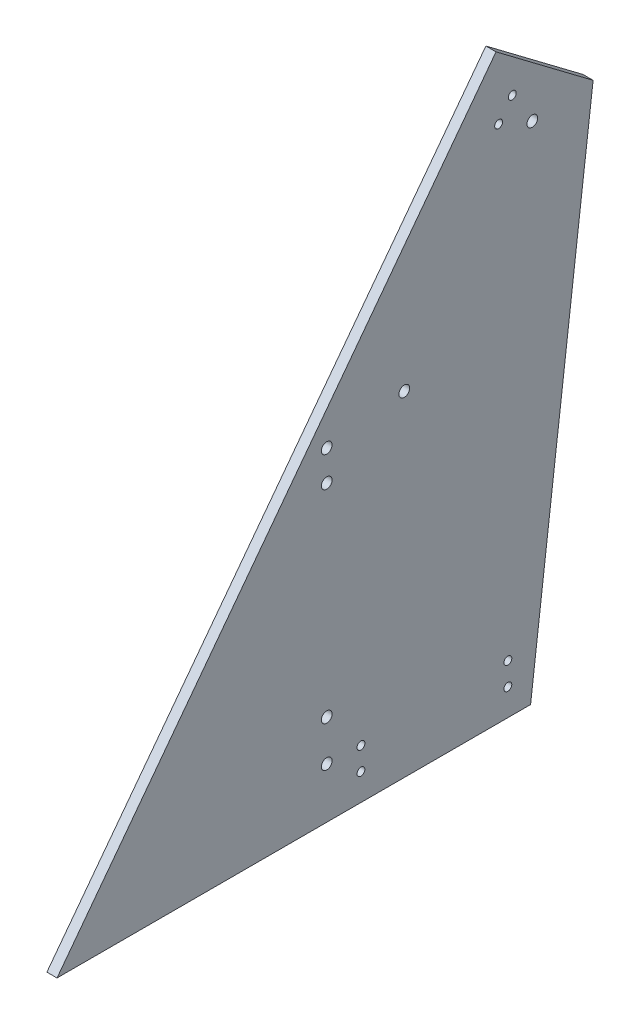
ISO-10303-21;
HEADER;
FILE_DESCRIPTION(('STEP AP214'),'2;1');
FILE_NAME('part.step','',(''),(''),'','','');
FILE_SCHEMA(('AUTOMOTIVE_DESIGN { 1 0 10303 214 1 1 1 1 }'));
ENDSEC;
DATA;
#1=APPLICATION_CONTEXT('core data for automotive mechanical design processes');
#2=APPLICATION_PROTOCOL_DEFINITION('international standard','automotive_design',2000,#1);
#3=PRODUCT_CONTEXT('',#1,'mechanical');
#4=PRODUCT('Part','Part','',(#3));
#5=PRODUCT_RELATED_PRODUCT_CATEGORY('part','',(#4));
#6=PRODUCT_DEFINITION_FORMATION('','',#4);
#7=PRODUCT_DEFINITION_CONTEXT('part definition',#1,'design');
#8=PRODUCT_DEFINITION('design','',#6,#7);
#9=PRODUCT_DEFINITION_SHAPE('','',#8);
#10=(LENGTH_UNIT() NAMED_UNIT(*) SI_UNIT(.MILLI.,.METRE.));
#11=(NAMED_UNIT(*) PLANE_ANGLE_UNIT() SI_UNIT($,.RADIAN.));
#12=(NAMED_UNIT(*) SI_UNIT($,.STERADIAN.) SOLID_ANGLE_UNIT());
#13=UNCERTAINTY_MEASURE_WITH_UNIT(LENGTH_MEASURE(1.E-05),#10,'distance_accuracy_value','');
#14=(GEOMETRIC_REPRESENTATION_CONTEXT(3) GLOBAL_UNCERTAINTY_ASSIGNED_CONTEXT((#13)) GLOBAL_UNIT_ASSIGNED_CONTEXT((#10,
#11,#12)) REPRESENTATION_CONTEXT('',''));
#15=CARTESIAN_POINT('',(0.,0.,0.));
#16=DIRECTION('',(0.,0.,1.));
#17=DIRECTION('',(1.,0.,0.));
#18=AXIS2_PLACEMENT_3D('',#15,#16,#17);
#19=CARTESIAN_POINT('',(6.35,0.,-296.803463779718));
#20=DIRECTION('',(0.,1.,0.));
#21=DIRECTION('',(0.,0.,1.));
#22=AXIS2_PLACEMENT_3D('',#19,#20,#21);
#23=PLANE('',#22);
#24=DIRECTION('',(0.,0.,-1.));
#25=VECTOR('',#24,1.);
#26=CARTESIAN_POINT('',(0.,0.,-296.803463779718));
#27=LINE('',#26,#25);
#28=CARTESIAN_POINT('',(0.,0.,0.));
#29=VERTEX_POINT('',#28);
#30=CARTESIAN_POINT('',(0.,0.,-296.803463779718));
#31=VERTEX_POINT('',#30);
#32=EDGE_CURVE('E100',#29,#31,#27,.T.);
#33=ORIENTED_EDGE('',*,*,#32,.T.);
#34=DIRECTION('',(-1.,0.,0.));
#35=VECTOR('',#34,1.);
#36=CARTESIAN_POINT('',(6.35,0.,-296.803463779718));
#37=LINE('',#36,#35);
#38=CARTESIAN_POINT('',(6.35,0.,-296.803463779718));
#39=VERTEX_POINT('',#38);
#40=EDGE_CURVE('E11',#39,#31,#37,.T.);
#41=ORIENTED_EDGE('',*,*,#40,.F.);
#42=DIRECTION('',(0.,0.,-1.));
#43=VECTOR('',#42,1.);
#44=CARTESIAN_POINT('',(6.35,0.,-296.803463779718));
#45=LINE('',#44,#43);
#46=CARTESIAN_POINT('',(6.35,0.,0.));
#47=VERTEX_POINT('',#46);
#48=EDGE_CURVE('E88',#47,#39,#45,.T.);
#49=ORIENTED_EDGE('',*,*,#48,.F.);
#50=DIRECTION('',(-1.,0.,0.));
#51=VECTOR('',#50,1.);
#52=CARTESIAN_POINT('',(6.35,0.,0.));
#53=LINE('',#52,#51);
#54=EDGE_CURVE('E96',#47,#29,#53,.T.);
#55=ORIENTED_EDGE('',*,*,#54,.T.);
#56=EDGE_LOOP('',(#33,#41,#49,#55));
#57=FACE_BOUND('',#56,.T.);
#58=ADVANCED_FACE('F37',(#57),#23,.F.);
#59=CARTESIAN_POINT('',(6.35,319.277850429435,-336.005854450722));
#60=DIRECTION('',(0.,0.121869343405155,0.992546151641321));
#61=DIRECTION('',(0.,-0.992546151641321,0.121869343405155));
#62=AXIS2_PLACEMENT_3D('',#59,#60,#61);
#63=PLANE('',#62);
#64=DIRECTION('',(0.,0.992546151641321,-0.121869343405155));
#65=VECTOR('',#64,1.);
#66=CARTESIAN_POINT('',(0.,319.277850429435,-336.005854450722));
#67=LINE('',#66,#65);
#68=CARTESIAN_POINT('',(0.,319.277850429435,-336.005854450722));
#69=VERTEX_POINT('',#68);
#70=EDGE_CURVE('E92',#31,#69,#67,.T.);
#71=ORIENTED_EDGE('',*,*,#70,.T.);
#72=DIRECTION('',(-1.,0.,0.));
#73=VECTOR('',#72,1.);
#74=CARTESIAN_POINT('',(6.35,319.277850429435,-336.005854450722));
#75=LINE('',#74,#73);
#76=CARTESIAN_POINT('',(6.35,319.277850429435,-336.005854450722));
#77=VERTEX_POINT('',#76);
#78=EDGE_CURVE('E45',#77,#69,#75,.T.);
#79=ORIENTED_EDGE('',*,*,#78,.F.);
#80=DIRECTION('',(0.,0.992546151641321,-0.121869343405155));
#81=VECTOR('',#80,1.);
#82=CARTESIAN_POINT('',(6.35,319.277850429435,-336.005854450722));
#83=LINE('',#82,#81);
#84=EDGE_CURVE('E83',#39,#77,#83,.T.);
#85=ORIENTED_EDGE('',*,*,#84,.F.);
#86=ORIENTED_EDGE('',*,*,#40,.T.);
#87=EDGE_LOOP('',(#71,#79,#85,#86));
#88=FACE_BOUND('',#87,.T.);
#89=ADVANCED_FACE('F91',(#88),#63,.F.);
#90=CARTESIAN_POINT('',(6.35,365.136155193621,-275.149828585118));
#91=DIRECTION('',(0.,-0.79863551004729,0.601815023152052));
#92=DIRECTION('',(0.,-0.601815023152052,-0.79863551004729));
#93=AXIS2_PLACEMENT_3D('',#90,#91,#92);
#94=PLANE('',#93);
#95=DIRECTION('',(0.,0.601815023152052,0.79863551004729));
#96=VECTOR('',#95,1.);
#97=CARTESIAN_POINT('',(0.,365.136155193621,-275.149828585118));
#98=LINE('',#97,#96);
#99=CARTESIAN_POINT('',(0.,365.136155193621,-275.149828585118));
#100=VERTEX_POINT('',#99);
#101=EDGE_CURVE('E70',#69,#100,#98,.T.);
#102=ORIENTED_EDGE('',*,*,#101,.T.);
#103=DIRECTION('',(-1.,0.,0.));
#104=VECTOR('',#103,1.);
#105=CARTESIAN_POINT('',(6.35,365.136155193621,-275.149828585118));
#106=LINE('',#105,#104);
#107=CARTESIAN_POINT('',(6.35,365.136155193621,-275.149828585118));
#108=VERTEX_POINT('',#107);
#109=EDGE_CURVE('E93',#108,#100,#106,.T.);
#110=ORIENTED_EDGE('',*,*,#109,.F.);
#111=DIRECTION('',(0.,0.601815023152052,0.79863551004729));
#112=VECTOR('',#111,1.);
#113=CARTESIAN_POINT('',(6.35,365.136155193621,-275.149828585118));
#114=LINE('',#113,#112);
#115=EDGE_CURVE('E86',#77,#108,#114,.T.);
#116=ORIENTED_EDGE('',*,*,#115,.F.);
#117=ORIENTED_EDGE('',*,*,#78,.T.);
#118=EDGE_LOOP('',(#102,#110,#116,#117));
#119=FACE_BOUND('',#118,.T.);
#120=ADVANCED_FACE('F94',(#119),#94,.F.);
#121=CARTESIAN_POINT('',(6.35,0.,0.));
#122=DIRECTION('',(0.,-0.601815023152052,-0.79863551004729));
#123=DIRECTION('',(0.,0.79863551004729,-0.601815023152052));
#124=AXIS2_PLACEMENT_3D('',#121,#122,#123);
#125=PLANE('',#124);
#126=DIRECTION('',(0.,-0.79863551004729,0.601815023152052));
#127=VECTOR('',#126,1.);
#128=CARTESIAN_POINT('',(0.,0.,0.));
#129=LINE('',#128,#127);
#130=EDGE_CURVE('E76',#100,#29,#129,.T.);
#131=ORIENTED_EDGE('',*,*,#130,.T.);
#132=ORIENTED_EDGE('',*,*,#54,.F.);
#133=DIRECTION('',(0.,-0.79863551004729,0.601815023152052));
#134=VECTOR('',#133,1.);
#135=CARTESIAN_POINT('',(6.35,0.,0.));
#136=LINE('',#135,#134);
#137=EDGE_CURVE('E53',#108,#47,#136,.T.);
#138=ORIENTED_EDGE('',*,*,#137,.F.);
#139=ORIENTED_EDGE('',*,*,#109,.T.);
#140=EDGE_LOOP('',(#131,#132,#138,#139));
#141=FACE_BOUND('',#140,.T.);
#142=ADVANCED_FACE('F108',(#141),#125,.F.);
#143=CARTESIAN_POINT('',(6.35,0.,0.));
#144=DIRECTION('',(1.,0.,0.));
#145=DIRECTION('',(0.,0.,-1.));
#146=AXIS2_PLACEMENT_3D('',#143,#144,#145);
#147=PLANE('',#146);
#148=CARTESIAN_POINT('',(6.35,316.189372760803,-297.898743163058));
#149=DIRECTION('',(1.,0.,0.));
#150=DIRECTION('',(0.,0.,-1.));
#151=AXIS2_PLACEMENT_3D('',#148,#149,#150);
#152=CIRCLE('',#151,3.36550000000002);
#153=CARTESIAN_POINT('',(6.35,316.189372760803,-301.264243163058));
#154=VERTEX_POINT('',#153);
#155=EDGE_CURVE('E180',#154,#154,#152,.T.);
#156=ORIENTED_EDGE('',*,*,#155,.F.);
#157=EDGE_LOOP('',(#156));
#158=FACE_BOUND('',#157,.T.);
#159=CARTESIAN_POINT('',(6.35,209.691327495997,-217.646709825732));
#160=DIRECTION('',(1.,0.,0.));
#161=DIRECTION('',(0.,0.,-1.));
#162=AXIS2_PLACEMENT_3D('',#159,#160,#161);
#163=CIRCLE('',#162,3.36550000000002);
#164=CARTESIAN_POINT('',(6.35,209.691327495997,-221.012209825732));
#165=VERTEX_POINT('',#164);
#166=EDGE_CURVE('E174',#165,#165,#163,.T.);
#167=ORIENTED_EDGE('',*,*,#166,.F.);
#168=EDGE_LOOP('',(#167));
#169=FACE_BOUND('',#168,.T.);
#170=CARTESIAN_POINT('',(6.35,336.461727915126,-285.346343492198));
#171=DIRECTION('',(1.,0.,0.));
#172=DIRECTION('',(0.,0.,-1.));
#173=AXIS2_PLACEMENT_3D('',#170,#171,#172);
#174=CIRCLE('',#173,2.4638);
#175=CARTESIAN_POINT('',(6.35,336.461727915126,-287.810143492198));
#176=VERTEX_POINT('',#175);
#177=EDGE_CURVE('E156',#176,#176,#174,.T.);
#178=ORIENTED_EDGE('',*,*,#177,.F.);
#179=EDGE_LOOP('',(#178));
#180=FACE_BOUND('',#179,.T.);
#181=CARTESIAN_POINT('',(6.35,16.764,-282.575));
#182=DIRECTION('',(1.,0.,0.));
#183=DIRECTION('',(0.,0.,-1.));
#184=AXIS2_PLACEMENT_3D('',#181,#182,#183);
#185=CIRCLE('',#184,2.4638);
#186=CARTESIAN_POINT('',(6.35,16.764,-285.0388));
#187=VERTEX_POINT('',#186);
#188=EDGE_CURVE('E163',#187,#187,#185,.T.);
#189=ORIENTED_EDGE('',*,*,#188,.F.);
#190=EDGE_LOOP('',(#189));
#191=FACE_BOUND('',#190,.T.);
#192=CARTESIAN_POINT('',(6.35,30.988,-282.575));
#193=DIRECTION('',(1.,0.,0.));
#194=DIRECTION('',(0.,0.,-1.));
#195=AXIS2_PLACEMENT_3D('',#192,#193,#194);
#196=CIRCLE('',#195,2.4638);
#197=CARTESIAN_POINT('',(6.35,30.988,-285.0388));
#198=VERTEX_POINT('',#197);
#199=EDGE_CURVE('E144',#198,#198,#196,.T.);
#200=ORIENTED_EDGE('',*,*,#199,.F.);
#201=EDGE_LOOP('',(#200));
#202=FACE_BOUND('',#201,.T.);
#203=CARTESIAN_POINT('',(6.35,16.764,-190.5));
#204=DIRECTION('',(1.,0.,0.));
#205=DIRECTION('',(0.,0.,-1.));
#206=AXIS2_PLACEMENT_3D('',#203,#204,#205);
#207=CIRCLE('',#206,2.4638);
#208=CARTESIAN_POINT('',(6.35,16.764,-192.9638));
#209=VERTEX_POINT('',#208);
#210=EDGE_CURVE('E151',#209,#209,#207,.T.);
#211=ORIENTED_EDGE('',*,*,#210,.F.);
#212=EDGE_LOOP('',(#211));
#213=FACE_BOUND('',#212,.T.);
#214=CARTESIAN_POINT('',(6.35,325.101936420213,-276.786126602884));
#215=DIRECTION('',(1.,0.,0.));
#216=DIRECTION('',(0.,0.,-1.));
#217=AXIS2_PLACEMENT_3D('',#214,#215,#216);
#218=CIRCLE('',#217,2.4638);
#219=CARTESIAN_POINT('',(6.35,325.101936420213,-279.249926602884));
#220=VERTEX_POINT('',#219);
#221=EDGE_CURVE('E168',#220,#220,#218,.T.);
#222=ORIENTED_EDGE('',*,*,#221,.F.);
#223=EDGE_LOOP('',(#222));
#224=FACE_BOUND('',#223,.T.);
#225=CARTESIAN_POINT('',(6.35,30.988,-190.5));
#226=DIRECTION('',(1.,0.,0.));
#227=DIRECTION('',(0.,0.,-1.));
#228=AXIS2_PLACEMENT_3D('',#225,#226,#227);
#229=CIRCLE('',#228,2.4638);
#230=CARTESIAN_POINT('',(6.35,30.988,-192.9638));
#231=VERTEX_POINT('',#230);
#232=EDGE_CURVE('E138',#231,#231,#229,.T.);
#233=ORIENTED_EDGE('',*,*,#232,.F.);
#234=EDGE_LOOP('',(#233));
#235=FACE_BOUND('',#234,.T.);
#236=CARTESIAN_POINT('',(6.35,203.2,-169.042319417195));
#237=DIRECTION('',(1.,0.,0.));
#238=DIRECTION('',(0.,0.,-1.));
#239=AXIS2_PLACEMENT_3D('',#236,#237,#238);
#240=CIRCLE('',#239,3.36549999999999);
#241=CARTESIAN_POINT('',(6.35,203.2,-172.407819417195));
#242=VERTEX_POINT('',#241);
#243=EDGE_CURVE('E133',#242,#242,#240,.T.);
#244=ORIENTED_EDGE('',*,*,#243,.F.);
#245=EDGE_LOOP('',(#244));
#246=FACE_BOUND('',#245,.T.);
#247=CARTESIAN_POINT('',(6.35,184.15,-169.042319417195));
#248=DIRECTION('',(1.,0.,0.));
#249=DIRECTION('',(0.,0.,-1.));
#250=AXIS2_PLACEMENT_3D('',#247,#248,#249);
#251=CIRCLE('',#250,3.36549999999999);
#252=CARTESIAN_POINT('',(6.35,184.15,-172.407819417195));
#253=VERTEX_POINT('',#252);
#254=EDGE_CURVE('E127',#253,#253,#251,.T.);
#255=ORIENTED_EDGE('',*,*,#254,.F.);
#256=EDGE_LOOP('',(#255));
#257=FACE_BOUND('',#256,.T.);
#258=CARTESIAN_POINT('',(6.35,57.15,-169.042319417195));
#259=DIRECTION('',(1.,0.,0.));
#260=DIRECTION('',(0.,0.,-1.));
#261=AXIS2_PLACEMENT_3D('',#258,#259,#260);
#262=CIRCLE('',#261,3.36549999999999);
#263=CARTESIAN_POINT('',(6.35,57.15,-172.407819417195));
#264=VERTEX_POINT('',#263);
#265=EDGE_CURVE('E121',#264,#264,#262,.T.);
#266=ORIENTED_EDGE('',*,*,#265,.F.);
#267=EDGE_LOOP('',(#266));
#268=FACE_BOUND('',#267,.T.);
#269=CARTESIAN_POINT('',(6.35,31.75,-169.042319417195));
#270=DIRECTION('',(1.,0.,0.));
#271=DIRECTION('',(0.,0.,-1.));
#272=AXIS2_PLACEMENT_3D('',#269,#270,#271);
#273=CIRCLE('',#272,3.36549999999999);
#274=CARTESIAN_POINT('',(6.35,31.75,-172.407819417195));
#275=VERTEX_POINT('',#274);
#276=EDGE_CURVE('E114',#275,#275,#273,.T.);
#277=ORIENTED_EDGE('',*,*,#276,.F.);
#278=EDGE_LOOP('',(#277));
#279=FACE_BOUND('',#278,.T.);
#280=ORIENTED_EDGE('',*,*,#48,.T.);
#281=ORIENTED_EDGE('',*,*,#84,.T.);
#282=ORIENTED_EDGE('',*,*,#115,.T.);
#283=ORIENTED_EDGE('',*,*,#137,.T.);
#284=EDGE_LOOP('',(#280,#281,#282,#283));
#285=FACE_BOUND('',#284,.T.);
#286=ADVANCED_FACE('F84',(#158,#169,#180,#191,#202,#213,#224,#235,#246,#257,#268,#279,#285),
#147,.T.);
#287=CARTESIAN_POINT('',(0.,0.,0.));
#288=DIRECTION('',(1.,0.,0.));
#289=DIRECTION('',(0.,0.,-1.));
#290=AXIS2_PLACEMENT_3D('',#287,#288,#289);
#291=PLANE('',#290);
#292=CARTESIAN_POINT('',(0.,316.189372760803,-297.898743163058));
#293=DIRECTION('',(1.,0.,0.));
#294=DIRECTION('',(0.,0.,-1.));
#295=AXIS2_PLACEMENT_3D('',#292,#293,#294);
#296=CIRCLE('',#295,3.36550000000002);
#297=CARTESIAN_POINT('',(0.,316.189372760803,-301.264243163058));
#298=VERTEX_POINT('',#297);
#299=EDGE_CURVE('E171',#298,#298,#296,.T.);
#300=ORIENTED_EDGE('',*,*,#299,.T.);
#301=EDGE_LOOP('',(#300));
#302=FACE_BOUND('',#301,.T.);
#303=CARTESIAN_POINT('',(0.,209.691327495997,-217.646709825732));
#304=DIRECTION('',(1.,0.,0.));
#305=DIRECTION('',(0.,0.,-1.));
#306=AXIS2_PLACEMENT_3D('',#303,#304,#305);
#307=CIRCLE('',#306,3.36550000000002);
#308=CARTESIAN_POINT('',(0.,209.691327495997,-221.012209825732));
#309=VERTEX_POINT('',#308);
#310=EDGE_CURVE('E177',#309,#309,#307,.T.);
#311=ORIENTED_EDGE('',*,*,#310,.T.);
#312=EDGE_LOOP('',(#311));
#313=FACE_BOUND('',#312,.T.);
#314=CARTESIAN_POINT('',(0.,336.461727915126,-285.346343492198));
#315=DIRECTION('',(1.,0.,0.));
#316=DIRECTION('',(0.,0.,-1.));
#317=AXIS2_PLACEMENT_3D('',#314,#315,#316);
#318=CIRCLE('',#317,2.4638);
#319=CARTESIAN_POINT('',(0.,336.461727915126,-287.810143492198));
#320=VERTEX_POINT('',#319);
#321=EDGE_CURVE('E159',#320,#320,#318,.T.);
#322=ORIENTED_EDGE('',*,*,#321,.T.);
#323=EDGE_LOOP('',(#322));
#324=FACE_BOUND('',#323,.T.);
#325=CARTESIAN_POINT('',(0.,16.764,-282.575));
#326=DIRECTION('',(1.,0.,0.));
#327=DIRECTION('',(0.,0.,-1.));
#328=AXIS2_PLACEMENT_3D('',#325,#326,#327);
#329=CIRCLE('',#328,2.4638);
#330=CARTESIAN_POINT('',(0.,16.764,-285.0388));
#331=VERTEX_POINT('',#330);
#332=EDGE_CURVE('E148',#331,#331,#329,.T.);
#333=ORIENTED_EDGE('',*,*,#332,.T.);
#334=EDGE_LOOP('',(#333));
#335=FACE_BOUND('',#334,.T.);
#336=CARTESIAN_POINT('',(0.,30.988,-282.575));
#337=DIRECTION('',(1.,0.,0.));
#338=DIRECTION('',(0.,0.,-1.));
#339=AXIS2_PLACEMENT_3D('',#336,#337,#338);
#340=CIRCLE('',#339,2.4638);
#341=CARTESIAN_POINT('',(0.,30.988,-285.0388));
#342=VERTEX_POINT('',#341);
#343=EDGE_CURVE('E147',#342,#342,#340,.T.);
#344=ORIENTED_EDGE('',*,*,#343,.T.);
#345=EDGE_LOOP('',(#344));
#346=FACE_BOUND('',#345,.T.);
#347=CARTESIAN_POINT('',(0.,16.764,-190.5));
#348=DIRECTION('',(1.,0.,0.));
#349=DIRECTION('',(0.,0.,-1.));
#350=AXIS2_PLACEMENT_3D('',#347,#348,#349);
#351=CIRCLE('',#350,2.4638);
#352=CARTESIAN_POINT('',(0.,16.764,-192.9638));
#353=VERTEX_POINT('',#352);
#354=EDGE_CURVE('E141',#353,#353,#351,.T.);
#355=ORIENTED_EDGE('',*,*,#354,.T.);
#356=EDGE_LOOP('',(#355));
#357=FACE_BOUND('',#356,.T.);
#358=CARTESIAN_POINT('',(0.,325.101936420213,-276.786126602884));
#359=DIRECTION('',(1.,0.,0.));
#360=DIRECTION('',(0.,0.,-1.));
#361=AXIS2_PLACEMENT_3D('',#358,#359,#360);
#362=CIRCLE('',#361,2.4638);
#363=CARTESIAN_POINT('',(0.,325.101936420213,-279.249926602884));
#364=VERTEX_POINT('',#363);
#365=EDGE_CURVE('E160',#364,#364,#362,.T.);
#366=ORIENTED_EDGE('',*,*,#365,.T.);
#367=EDGE_LOOP('',(#366));
#368=FACE_BOUND('',#367,.T.);
#369=CARTESIAN_POINT('',(0.,30.988,-190.5));
#370=DIRECTION('',(1.,0.,0.));
#371=DIRECTION('',(0.,0.,-1.));
#372=AXIS2_PLACEMENT_3D('',#369,#370,#371);
#373=CIRCLE('',#372,2.4638);
#374=CARTESIAN_POINT('',(0.,30.988,-192.9638));
#375=VERTEX_POINT('',#374);
#376=EDGE_CURVE('E118',#375,#375,#373,.T.);
#377=ORIENTED_EDGE('',*,*,#376,.T.);
#378=EDGE_LOOP('',(#377));
#379=FACE_BOUND('',#378,.T.);
#380=CARTESIAN_POINT('',(0.,203.2,-169.042319417195));
#381=DIRECTION('',(1.,0.,0.));
#382=DIRECTION('',(0.,0.,-1.));
#383=AXIS2_PLACEMENT_3D('',#380,#381,#382);
#384=CIRCLE('',#383,3.36549999999999);
#385=CARTESIAN_POINT('',(0.,203.2,-172.407819417195));
#386=VERTEX_POINT('',#385);
#387=EDGE_CURVE('E103',#386,#386,#384,.T.);
#388=ORIENTED_EDGE('',*,*,#387,.T.);
#389=EDGE_LOOP('',(#388));
#390=FACE_BOUND('',#389,.T.);
#391=CARTESIAN_POINT('',(0.,184.15,-169.042319417195));
#392=DIRECTION('',(1.,0.,0.));
#393=DIRECTION('',(0.,0.,-1.));
#394=AXIS2_PLACEMENT_3D('',#391,#392,#393);
#395=CIRCLE('',#394,3.36549999999999);
#396=CARTESIAN_POINT('',(0.,184.15,-172.407819417195));
#397=VERTEX_POINT('',#396);
#398=EDGE_CURVE('E130',#397,#397,#395,.T.);
#399=ORIENTED_EDGE('',*,*,#398,.T.);
#400=EDGE_LOOP('',(#399));
#401=FACE_BOUND('',#400,.T.);
#402=CARTESIAN_POINT('',(0.,57.15,-169.042319417195));
#403=DIRECTION('',(1.,0.,0.));
#404=DIRECTION('',(0.,0.,-1.));
#405=AXIS2_PLACEMENT_3D('',#402,#403,#404);
#406=CIRCLE('',#405,3.36549999999999);
#407=CARTESIAN_POINT('',(0.,57.15,-172.407819417195));
#408=VERTEX_POINT('',#407);
#409=EDGE_CURVE('E124',#408,#408,#406,.T.);
#410=ORIENTED_EDGE('',*,*,#409,.T.);
#411=EDGE_LOOP('',(#410));
#412=FACE_BOUND('',#411,.T.);
#413=CARTESIAN_POINT('',(0.,31.75,-169.042319417195));
#414=DIRECTION('',(1.,0.,0.));
#415=DIRECTION('',(0.,0.,-1.));
#416=AXIS2_PLACEMENT_3D('',#413,#414,#415);
#417=CIRCLE('',#416,3.36549999999999);
#418=CARTESIAN_POINT('',(0.,31.75,-172.407819417195));
#419=VERTEX_POINT('',#418);
#420=EDGE_CURVE('E117',#419,#419,#417,.T.);
#421=ORIENTED_EDGE('',*,*,#420,.T.);
#422=EDGE_LOOP('',(#421));
#423=FACE_BOUND('',#422,.T.);
#424=ORIENTED_EDGE('',*,*,#32,.F.);
#425=ORIENTED_EDGE('',*,*,#130,.F.);
#426=ORIENTED_EDGE('',*,*,#101,.F.);
#427=ORIENTED_EDGE('',*,*,#70,.F.);
#428=EDGE_LOOP('',(#424,#425,#426,#427));
#429=FACE_BOUND('',#428,.T.);
#430=ADVANCED_FACE('F111',(#302,#313,#324,#335,#346,#357,#368,#379,#390,#401,#412,#423,#429),
#291,.F.);
#431=CARTESIAN_POINT('',(0.,31.75,-169.042319417195));
#432=DIRECTION('',(1.,0.,0.));
#433=DIRECTION('',(0.,0.,-1.));
#434=AXIS2_PLACEMENT_3D('',#431,#432,#433);
#435=CYLINDRICAL_SURFACE('',#434,3.36549999999999);
#436=ORIENTED_EDGE('',*,*,#420,.F.);
#437=EDGE_LOOP('',(#436));
#438=FACE_BOUND('',#437,.T.);
#439=ORIENTED_EDGE('',*,*,#276,.T.);
#440=EDGE_LOOP('',(#439));
#441=FACE_BOUND('',#440,.T.);
#442=ADVANCED_FACE('F220',(#438,#441),#435,.F.);
#443=CARTESIAN_POINT('',(0.,57.15,-169.042319417195));
#444=DIRECTION('',(1.,0.,0.));
#445=DIRECTION('',(0.,0.,-1.));
#446=AXIS2_PLACEMENT_3D('',#443,#444,#445);
#447=CYLINDRICAL_SURFACE('',#446,3.36549999999999);
#448=ORIENTED_EDGE('',*,*,#409,.F.);
#449=EDGE_LOOP('',(#448));
#450=FACE_BOUND('',#449,.T.);
#451=ORIENTED_EDGE('',*,*,#265,.T.);
#452=EDGE_LOOP('',(#451));
#453=FACE_BOUND('',#452,.T.);
#454=ADVANCED_FACE('F222',(#450,#453),#447,.F.);
#455=CARTESIAN_POINT('',(0.,184.15,-169.042319417195));
#456=DIRECTION('',(1.,0.,0.));
#457=DIRECTION('',(0.,0.,-1.));
#458=AXIS2_PLACEMENT_3D('',#455,#456,#457);
#459=CYLINDRICAL_SURFACE('',#458,3.36549999999999);
#460=ORIENTED_EDGE('',*,*,#398,.F.);
#461=EDGE_LOOP('',(#460));
#462=FACE_BOUND('',#461,.T.);
#463=ORIENTED_EDGE('',*,*,#254,.T.);
#464=EDGE_LOOP('',(#463));
#465=FACE_BOUND('',#464,.T.);
#466=ADVANCED_FACE('F229',(#462,#465),#459,.F.);
#467=CARTESIAN_POINT('',(0.,203.2,-169.042319417195));
#468=DIRECTION('',(1.,0.,0.));
#469=DIRECTION('',(0.,0.,-1.));
#470=AXIS2_PLACEMENT_3D('',#467,#468,#469);
#471=CYLINDRICAL_SURFACE('',#470,3.36549999999999);
#472=ORIENTED_EDGE('',*,*,#387,.F.);
#473=EDGE_LOOP('',(#472));
#474=FACE_BOUND('',#473,.T.);
#475=ORIENTED_EDGE('',*,*,#243,.T.);
#476=EDGE_LOOP('',(#475));
#477=FACE_BOUND('',#476,.T.);
#478=ADVANCED_FACE('F321',(#474,#477),#471,.F.);
#479=CARTESIAN_POINT('',(0.,30.988,-190.5));
#480=DIRECTION('',(1.,0.,0.));
#481=DIRECTION('',(0.,0.,-1.));
#482=AXIS2_PLACEMENT_3D('',#479,#480,#481);
#483=CYLINDRICAL_SURFACE('',#482,2.4638);
#484=ORIENTED_EDGE('',*,*,#376,.F.);
#485=EDGE_LOOP('',(#484));
#486=FACE_BOUND('',#485,.T.);
#487=ORIENTED_EDGE('',*,*,#232,.T.);
#488=EDGE_LOOP('',(#487));
#489=FACE_BOUND('',#488,.T.);
#490=ADVANCED_FACE('F313',(#486,#489),#483,.F.);
#491=CARTESIAN_POINT('',(0.,325.101936420213,-276.786126602884));
#492=DIRECTION('',(1.,0.,0.));
#493=DIRECTION('',(0.,0.,-1.));
#494=AXIS2_PLACEMENT_3D('',#491,#492,#493);
#495=CYLINDRICAL_SURFACE('',#494,2.4638);
#496=ORIENTED_EDGE('',*,*,#365,.F.);
#497=EDGE_LOOP('',(#496));
#498=FACE_BOUND('',#497,.T.);
#499=ORIENTED_EDGE('',*,*,#221,.T.);
#500=EDGE_LOOP('',(#499));
#501=FACE_BOUND('',#500,.T.);
#502=ADVANCED_FACE('F305',(#498,#501),#495,.F.);
#503=CARTESIAN_POINT('',(0.,16.764,-190.5));
#504=DIRECTION('',(1.,0.,0.));
#505=DIRECTION('',(0.,0.,-1.));
#506=AXIS2_PLACEMENT_3D('',#503,#504,#505);
#507=CYLINDRICAL_SURFACE('',#506,2.4638);
#508=ORIENTED_EDGE('',*,*,#354,.F.);
#509=EDGE_LOOP('',(#508));
#510=FACE_BOUND('',#509,.T.);
#511=ORIENTED_EDGE('',*,*,#210,.T.);
#512=EDGE_LOOP('',(#511));
#513=FACE_BOUND('',#512,.T.);
#514=ADVANCED_FACE('F297',(#510,#513),#507,.F.);
#515=CARTESIAN_POINT('',(0.,30.988,-282.575));
#516=DIRECTION('',(1.,0.,0.));
#517=DIRECTION('',(0.,0.,-1.));
#518=AXIS2_PLACEMENT_3D('',#515,#516,#517);
#519=CYLINDRICAL_SURFACE('',#518,2.4638);
#520=ORIENTED_EDGE('',*,*,#343,.F.);
#521=EDGE_LOOP('',(#520));
#522=FACE_BOUND('',#521,.T.);
#523=ORIENTED_EDGE('',*,*,#199,.T.);
#524=EDGE_LOOP('',(#523));
#525=FACE_BOUND('',#524,.T.);
#526=ADVANCED_FACE('F289',(#522,#525),#519,.F.);
#527=CARTESIAN_POINT('',(0.,16.764,-282.575));
#528=DIRECTION('',(1.,0.,0.));
#529=DIRECTION('',(0.,0.,-1.));
#530=AXIS2_PLACEMENT_3D('',#527,#528,#529);
#531=CYLINDRICAL_SURFACE('',#530,2.4638);
#532=ORIENTED_EDGE('',*,*,#332,.F.);
#533=EDGE_LOOP('',(#532));
#534=FACE_BOUND('',#533,.T.);
#535=ORIENTED_EDGE('',*,*,#188,.T.);
#536=EDGE_LOOP('',(#535));
#537=FACE_BOUND('',#536,.T.);
#538=ADVANCED_FACE('F282',(#534,#537),#531,.F.);
#539=CARTESIAN_POINT('',(0.,336.461727915126,-285.346343492198));
#540=DIRECTION('',(1.,0.,0.));
#541=DIRECTION('',(0.,0.,-1.));
#542=AXIS2_PLACEMENT_3D('',#539,#540,#541);
#543=CYLINDRICAL_SURFACE('',#542,2.4638);
#544=ORIENTED_EDGE('',*,*,#321,.F.);
#545=EDGE_LOOP('',(#544));
#546=FACE_BOUND('',#545,.T.);
#547=ORIENTED_EDGE('',*,*,#177,.T.);
#548=EDGE_LOOP('',(#547));
#549=FACE_BOUND('',#548,.T.);
#550=ADVANCED_FACE('F267',(#546,#549),#543,.F.);
#551=CARTESIAN_POINT('',(0.,209.691327495997,-217.646709825732));
#552=DIRECTION('',(1.,0.,0.));
#553=DIRECTION('',(0.,0.,-1.));
#554=AXIS2_PLACEMENT_3D('',#551,#552,#553);
#555=CYLINDRICAL_SURFACE('',#554,3.36550000000002);
#556=ORIENTED_EDGE('',*,*,#310,.F.);
#557=EDGE_LOOP('',(#556));
#558=FACE_BOUND('',#557,.T.);
#559=ORIENTED_EDGE('',*,*,#166,.T.);
#560=EDGE_LOOP('',(#559));
#561=FACE_BOUND('',#560,.T.);
#562=ADVANCED_FACE('F191',(#558,#561),#555,.F.);
#563=CARTESIAN_POINT('',(0.,316.189372760803,-297.898743163058));
#564=DIRECTION('',(1.,0.,0.));
#565=DIRECTION('',(0.,0.,-1.));
#566=AXIS2_PLACEMENT_3D('',#563,#564,#565);
#567=CYLINDRICAL_SURFACE('',#566,3.36550000000002);
#568=ORIENTED_EDGE('',*,*,#299,.F.);
#569=EDGE_LOOP('',(#568));
#570=FACE_BOUND('',#569,.T.);
#571=ORIENTED_EDGE('',*,*,#155,.T.);
#572=EDGE_LOOP('',(#571));
#573=FACE_BOUND('',#572,.T.);
#574=ADVANCED_FACE('F188',(#570,#573),#567,.F.);
#575=CLOSED_SHELL('',(#58,#89,#120,#142,#286,#430,#442,#454,#466,#478,#490,#502,#514,#526,#538,
#550,#562,#574));
#576=MANIFOLD_SOLID_BREP('B2',#575);
#577=ADVANCED_BREP_SHAPE_REPRESENTATION('',(#18,#576),#14);
#578=SHAPE_DEFINITION_REPRESENTATION(#9,#577);
ENDSEC;
END-ISO-10303-21;
